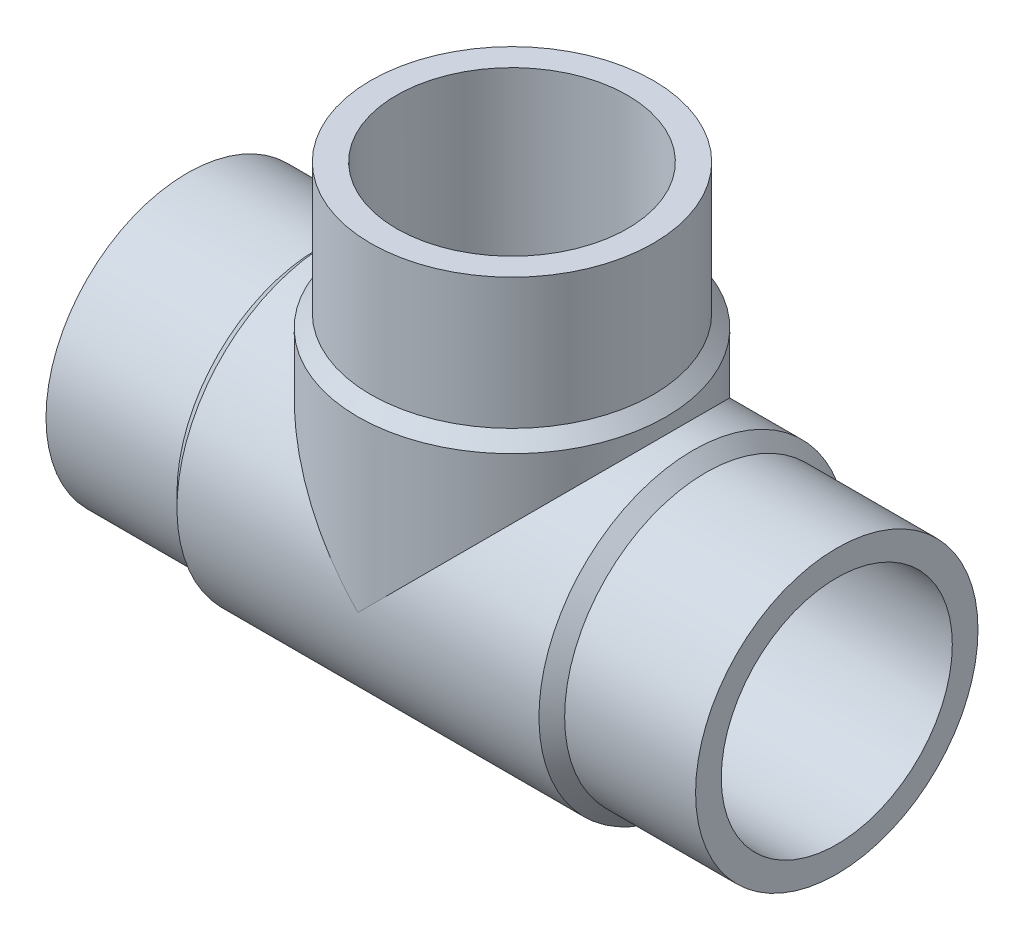
ISO-10303-21;
HEADER;
FILE_DESCRIPTION(('STEP AP214'),'2;1');
FILE_NAME('part.step','',(''),(''),'','','');
FILE_SCHEMA(('AUTOMOTIVE_DESIGN { 1 0 10303 214 1 1 1 1 }'));
ENDSEC;
DATA;
#1=APPLICATION_CONTEXT('core data for automotive mechanical design processes');
#2=APPLICATION_PROTOCOL_DEFINITION('international standard','automotive_design',2000,#1);
#3=PRODUCT_CONTEXT('',#1,'mechanical');
#4=PRODUCT('Part','Part','',(#3));
#5=PRODUCT_RELATED_PRODUCT_CATEGORY('part','',(#4));
#6=PRODUCT_DEFINITION_FORMATION('','',#4);
#7=PRODUCT_DEFINITION_CONTEXT('part definition',#1,'design');
#8=PRODUCT_DEFINITION('design','',#6,#7);
#9=PRODUCT_DEFINITION_SHAPE('','',#8);
#10=(LENGTH_UNIT() NAMED_UNIT(*) SI_UNIT(.MILLI.,.METRE.));
#11=(NAMED_UNIT(*) PLANE_ANGLE_UNIT() SI_UNIT($,.RADIAN.));
#12=(NAMED_UNIT(*) SI_UNIT($,.STERADIAN.) SOLID_ANGLE_UNIT());
#13=UNCERTAINTY_MEASURE_WITH_UNIT(LENGTH_MEASURE(1.E-05),#10,'distance_accuracy_value','');
#14=(GEOMETRIC_REPRESENTATION_CONTEXT(3) GLOBAL_UNCERTAINTY_ASSIGNED_CONTEXT((#13)) GLOBAL_UNIT_ASSIGNED_CONTEXT((#10,
#11,#12)) REPRESENTATION_CONTEXT('',''));
#15=CARTESIAN_POINT('',(0.,0.,0.));
#16=DIRECTION('',(0.,0.,1.));
#17=DIRECTION('',(1.,0.,0.));
#18=AXIS2_PLACEMENT_3D('',#15,#16,#17);
#19=CARTESIAN_POINT('',(-126.5,122.,0.));
#20=DIRECTION('',(0.,1.,0.));
#21=DIRECTION('',(0.,0.,1.));
#22=AXIS2_PLACEMENT_3D('',#19,#20,#21);
#23=CYLINDRICAL_SURFACE('',#22,55.);
#24=CARTESIAN_POINT('',(-126.5,122.,0.));
#25=DIRECTION('',(0.,1.,0.));
#26=DIRECTION('',(0.,0.,1.));
#27=AXIS2_PLACEMENT_3D('',#24,#25,#26);
#28=CIRCLE('',#27,55.);
#29=CARTESIAN_POINT('',(-126.5,122.,55.));
#30=VERTEX_POINT('',#29);
#31=EDGE_CURVE('E18',#30,#30,#28,.T.);
#32=ORIENTED_EDGE('',*,*,#31,.F.);
#33=EDGE_LOOP('',(#32));
#34=FACE_BOUND('',#33,.T.);
#35=CARTESIAN_POINT('',(-126.5,71.,0.));
#36=DIRECTION('',(0.,1.,0.));
#37=DIRECTION('',(1.,0.,0.));
#38=AXIS2_PLACEMENT_3D('',#35,#36,#37);
#39=CIRCLE('',#38,55.);
#40=CARTESIAN_POINT('',(-71.5,71.,0.));
#41=VERTEX_POINT('',#40);
#42=EDGE_CURVE('E71',#41,#41,#39,.F.);
#43=ORIENTED_EDGE('',*,*,#42,.F.);
#44=EDGE_LOOP('',(#43));
#45=FACE_BOUND('',#44,.T.);
#46=ADVANCED_FACE('F15',(#34,#45),#23,.T.);
#47=CARTESIAN_POINT('',(-126.5,71.,0.));
#48=DIRECTION('',(0.,-1.,0.));
#49=DIRECTION('',(0.,0.,-1.));
#50=AXIS2_PLACEMENT_3D('',#47,#48,#49);
#51=CONICAL_SURFACE('',#50,55.,0.785398163397444);
#52=CARTESIAN_POINT('',(-126.5,66.,0.));
#53=DIRECTION('',(0.,1.,0.));
#54=DIRECTION('',(1.,0.,0.));
#55=AXIS2_PLACEMENT_3D('',#52,#53,#54);
#56=CIRCLE('',#55,60.);
#57=CARTESIAN_POINT('',(-66.5,66.,0.));
#58=VERTEX_POINT('',#57);
#59=EDGE_CURVE('E60',#58,#58,#56,.F.);
#60=ORIENTED_EDGE('',*,*,#59,.F.);
#61=EDGE_LOOP('',(#60));
#62=FACE_BOUND('',#61,.T.);
#63=ORIENTED_EDGE('',*,*,#42,.T.);
#64=EDGE_LOOP('',(#63));
#65=FACE_BOUND('',#64,.T.);
#66=ADVANCED_FACE('F141',(#62,#65),#51,.T.);
#67=CARTESIAN_POINT('',(-51.,0.,0.));
#68=DIRECTION('',(-1.,0.,0.));
#69=DIRECTION('',(0.,0.,1.));
#70=AXIS2_PLACEMENT_3D('',#67,#68,#69);
#71=CYLINDRICAL_SURFACE('',#70,55.);
#72=CARTESIAN_POINT('',(-51.,0.,0.));
#73=DIRECTION('',(1.,0.,0.));
#74=DIRECTION('',(0.,1.,0.));
#75=AXIS2_PLACEMENT_3D('',#72,#73,#74);
#76=CIRCLE('',#75,55.);
#77=CARTESIAN_POINT('',(-51.,55.,0.));
#78=VERTEX_POINT('',#77);
#79=EDGE_CURVE('E64',#78,#78,#76,.F.);
#80=ORIENTED_EDGE('',*,*,#79,.F.);
#81=EDGE_LOOP('',(#80));
#82=FACE_BOUND('',#81,.T.);
#83=CARTESIAN_POINT('',(0.,0.,0.));
#84=DIRECTION('',(-1.,0.,0.));
#85=DIRECTION('',(0.,0.,1.));
#86=AXIS2_PLACEMENT_3D('',#83,#84,#85);
#87=CIRCLE('',#86,55.);
#88=CARTESIAN_POINT('',(0.,0.,55.));
#89=VERTEX_POINT('',#88);
#90=EDGE_CURVE('E58',#89,#89,#87,.F.);
#91=ORIENTED_EDGE('',*,*,#90,.F.);
#92=EDGE_LOOP('',(#91));
#93=FACE_BOUND('',#92,.T.);
#94=ADVANCED_FACE('F136',(#82,#93),#71,.T.);
#95=CARTESIAN_POINT('',(-181.5,122.,55.6600021084419));
#96=DIRECTION('',(0.,1.,0.));
#97=DIRECTION('',(1.,0.,0.));
#98=AXIS2_PLACEMENT_3D('',#95,#96,#97);
#99=PLANE('',#98);
#100=CARTESIAN_POINT('',(-126.5,122.,0.));
#101=DIRECTION('',(0.,1.,0.));
#102=DIRECTION('',(0.,0.,1.));
#103=AXIS2_PLACEMENT_3D('',#100,#101,#102);
#104=CIRCLE('',#103,45.);
#105=CARTESIAN_POINT('',(-126.5,122.,45.));
#106=VERTEX_POINT('',#105);
#107=EDGE_CURVE('E52',#106,#106,#104,.T.);
#108=ORIENTED_EDGE('',*,*,#107,.F.);
#109=EDGE_LOOP('',(#108));
#110=FACE_BOUND('',#109,.T.);
#111=ORIENTED_EDGE('',*,*,#31,.T.);
#112=EDGE_LOOP('',(#111));
#113=FACE_BOUND('',#112,.T.);
#114=ADVANCED_FACE('F130',(#110,#113),#99,.T.);
#115=CARTESIAN_POINT('',(-51.,0.,0.));
#116=DIRECTION('',(-1.,0.,0.));
#117=DIRECTION('',(0.,0.,1.));
#118=AXIS2_PLACEMENT_3D('',#115,#116,#117);
#119=CONICAL_SURFACE('',#118,55.,0.785398163397448);
#120=ORIENTED_EDGE('',*,*,#79,.T.);
#121=EDGE_LOOP('',(#120));
#122=FACE_BOUND('',#121,.T.);
#123=CARTESIAN_POINT('',(-56.,0.,0.));
#124=DIRECTION('',(-1.,0.,0.));
#125=DIRECTION('',(0.,1.,0.));
#126=AXIS2_PLACEMENT_3D('',#123,#124,#125);
#127=CIRCLE('',#126,60.);
#128=CARTESIAN_POINT('',(-56.,60.,0.));
#129=VERTEX_POINT('',#128);
#130=EDGE_CURVE('E49',#129,#129,#127,.T.);
#131=ORIENTED_EDGE('',*,*,#130,.F.);
#132=EDGE_LOOP('',(#131));
#133=FACE_BOUND('',#132,.T.);
#134=ADVANCED_FACE('F95',(#122,#133),#119,.T.);
#135=CARTESIAN_POINT('',(-126.5,66.,0.));
#136=DIRECTION('',(0.,1.,0.));
#137=DIRECTION('',(0.,0.,1.));
#138=AXIS2_PLACEMENT_3D('',#135,#136,#137);
#139=CYLINDRICAL_SURFACE('',#138,60.);
#140=CARTESIAN_POINT('',(-126.5,0.,0.));
#141=DIRECTION('',(0.707106781186547,0.707106781186547,0.));
#142=DIRECTION('',(-0.707106781186547,0.707106781186547,0.));
#143=AXIS2_PLACEMENT_3D('',#140,#141,#142);
#144=ELLIPSE('',#143,84.8528137423857,60.);
#145=CARTESIAN_POINT('',(-126.5,0.,60.));
#146=VERTEX_POINT('',#145);
#147=CARTESIAN_POINT('',(-126.5,0.,-60.));
#148=VERTEX_POINT('',#147);
#149=EDGE_CURVE('E44',#146,#148,#144,.F.);
#150=ORIENTED_EDGE('',*,*,#149,.F.);
#151=CARTESIAN_POINT('',(-126.5,0.,0.));
#152=DIRECTION('',(-0.707106781186547,0.707106781186547,0.));
#153=DIRECTION('',(0.707106781186547,0.707106781186547,0.));
#154=AXIS2_PLACEMENT_3D('',#151,#152,#153);
#155=ELLIPSE('',#154,84.8528137423857,60.);
#156=EDGE_CURVE('E40',#148,#146,#155,.F.);
#157=ORIENTED_EDGE('',*,*,#156,.F.);
#158=EDGE_LOOP('',(#150,#157));
#159=FACE_BOUND('',#158,.T.);
#160=ORIENTED_EDGE('',*,*,#59,.T.);
#161=EDGE_LOOP('',(#160));
#162=FACE_BOUND('',#161,.T.);
#163=ADVANCED_FACE('F47',(#159,#162),#139,.T.);
#164=CARTESIAN_POINT('',(0.,55.,55.6600021081709));
#165=DIRECTION('',(1.,0.,0.));
#166=DIRECTION('',(0.,-1.,0.));
#167=AXIS2_PLACEMENT_3D('',#164,#165,#166);
#168=PLANE('',#167);
#169=CARTESIAN_POINT('',(0.,0.,0.));
#170=DIRECTION('',(-1.,0.,0.));
#171=DIRECTION('',(0.,0.,1.));
#172=AXIS2_PLACEMENT_3D('',#169,#170,#171);
#173=CIRCLE('',#172,45.);
#174=CARTESIAN_POINT('',(0.,0.,45.));
#175=VERTEX_POINT('',#174);
#176=EDGE_CURVE('E45',#175,#175,#173,.F.);
#177=ORIENTED_EDGE('',*,*,#176,.F.);
#178=EDGE_LOOP('',(#177));
#179=FACE_BOUND('',#178,.T.);
#180=ORIENTED_EDGE('',*,*,#90,.T.);
#181=EDGE_LOOP('',(#180));
#182=FACE_BOUND('',#181,.T.);
#183=ADVANCED_FACE('F85',(#179,#182),#168,.T.);
#184=CARTESIAN_POINT('',(-126.5,0.,0.));
#185=DIRECTION('',(0.,1.,0.));
#186=DIRECTION('',(0.,0.,1.));
#187=AXIS2_PLACEMENT_3D('',#184,#185,#186);
#188=CYLINDRICAL_SURFACE('',#187,45.);
#189=CARTESIAN_POINT('',(-126.5,0.,0.));
#190=DIRECTION('',(-0.707106781186547,-0.707106781186547,0.));
#191=DIRECTION('',(-0.707106781186547,0.707106781186547,0.));
#192=AXIS2_PLACEMENT_3D('',#189,#190,#191);
#193=ELLIPSE('',#192,63.6396103067893,45.);
#194=CARTESIAN_POINT('',(-126.5,0.,-45.));
#195=VERTEX_POINT('',#194);
#196=CARTESIAN_POINT('',(-126.5,0.,45.));
#197=VERTEX_POINT('',#196);
#198=EDGE_CURVE('E78',#195,#197,#193,.F.);
#199=ORIENTED_EDGE('',*,*,#198,.F.);
#200=CARTESIAN_POINT('',(-126.5,0.,0.));
#201=DIRECTION('',(-0.707106781186547,0.707106781186547,0.));
#202=DIRECTION('',(0.707106781186547,0.707106781186547,0.));
#203=AXIS2_PLACEMENT_3D('',#200,#201,#202);
#204=ELLIPSE('',#203,63.6396103067893,45.);
#205=EDGE_CURVE('E32',#195,#197,#204,.F.);
#206=ORIENTED_EDGE('',*,*,#205,.T.);
#207=EDGE_LOOP('',(#199,#206));
#208=FACE_BOUND('',#207,.T.);
#209=ORIENTED_EDGE('',*,*,#107,.T.);
#210=EDGE_LOOP('',(#209));
#211=FACE_BOUND('',#210,.T.);
#212=ADVANCED_FACE('F87',(#208,#211),#188,.F.);
#213=CARTESIAN_POINT('',(-197.,0.,0.));
#214=DIRECTION('',(-1.,0.,0.));
#215=DIRECTION('',(0.,0.,1.));
#216=AXIS2_PLACEMENT_3D('',#213,#214,#215);
#217=CYLINDRICAL_SURFACE('',#216,60.);
#218=ORIENTED_EDGE('',*,*,#130,.T.);
#219=EDGE_LOOP('',(#218));
#220=FACE_BOUND('',#219,.T.);
#221=CARTESIAN_POINT('',(-197.,0.,0.));
#222=DIRECTION('',(-1.,0.,0.));
#223=DIRECTION('',(0.,1.,0.));
#224=AXIS2_PLACEMENT_3D('',#221,#222,#223);
#225=CIRCLE('',#224,60.);
#226=CARTESIAN_POINT('',(-197.,60.,0.));
#227=VERTEX_POINT('',#226);
#228=EDGE_CURVE('E77',#227,#227,#225,.T.);
#229=ORIENTED_EDGE('',*,*,#228,.F.);
#230=EDGE_LOOP('',(#229));
#231=FACE_BOUND('',#230,.T.);
#232=ORIENTED_EDGE('',*,*,#149,.T.);
#233=ORIENTED_EDGE('',*,*,#156,.T.);
#234=EDGE_LOOP('',(#232,#233));
#235=FACE_BOUND('',#234,.T.);
#236=ADVANCED_FACE('F43',(#220,#231,#235),#217,.T.);
#237=CARTESIAN_POINT('',(-126.5,0.,0.));
#238=DIRECTION('',(-1.,0.,0.));
#239=DIRECTION('',(0.,0.,1.));
#240=AXIS2_PLACEMENT_3D('',#237,#238,#239);
#241=CYLINDRICAL_SURFACE('',#240,45.);
#242=ORIENTED_EDGE('',*,*,#205,.F.);
#243=ORIENTED_EDGE('',*,*,#198,.T.);
#244=EDGE_LOOP('',(#242,#243));
#245=FACE_BOUND('',#244,.T.);
#246=ORIENTED_EDGE('',*,*,#176,.T.);
#247=EDGE_LOOP('',(#246));
#248=FACE_BOUND('',#247,.T.);
#249=CARTESIAN_POINT('',(-253.,0.,0.));
#250=DIRECTION('',(-1.,0.,0.));
#251=DIRECTION('',(0.,0.,1.));
#252=AXIS2_PLACEMENT_3D('',#249,#250,#251);
#253=CIRCLE('',#252,45.);
#254=CARTESIAN_POINT('',(-253.,0.,45.));
#255=VERTEX_POINT('',#254);
#256=EDGE_CURVE('E74',#255,#255,#253,.F.);
#257=ORIENTED_EDGE('',*,*,#256,.F.);
#258=EDGE_LOOP('',(#257));
#259=FACE_BOUND('',#258,.T.);
#260=ADVANCED_FACE('F82',(#245,#248,#259),#241,.F.);
#261=CARTESIAN_POINT('',(-202.,0.,0.));
#262=DIRECTION('',(1.,0.,0.));
#263=DIRECTION('',(0.,0.,-1.));
#264=AXIS2_PLACEMENT_3D('',#261,#262,#263);
#265=CONICAL_SURFACE('',#264,55.,0.785398163397449);
#266=ORIENTED_EDGE('',*,*,#228,.T.);
#267=EDGE_LOOP('',(#266));
#268=FACE_BOUND('',#267,.T.);
#269=CARTESIAN_POINT('',(-202.,0.,0.));
#270=DIRECTION('',(-1.,0.,0.));
#271=DIRECTION('',(0.,1.,0.));
#272=AXIS2_PLACEMENT_3D('',#269,#270,#271);
#273=CIRCLE('',#272,55.);
#274=CARTESIAN_POINT('',(-202.,55.,0.));
#275=VERTEX_POINT('',#274);
#276=EDGE_CURVE('E24',#275,#275,#273,.T.);
#277=ORIENTED_EDGE('',*,*,#276,.F.);
#278=EDGE_LOOP('',(#277));
#279=FACE_BOUND('',#278,.T.);
#280=ADVANCED_FACE('F105',(#268,#279),#265,.T.);
#281=CARTESIAN_POINT('',(-253.,-55.,55.660002108172));
#282=DIRECTION('',(-1.,0.,0.));
#283=DIRECTION('',(0.,1.,0.));
#284=AXIS2_PLACEMENT_3D('',#281,#282,#283);
#285=PLANE('',#284);
#286=ORIENTED_EDGE('',*,*,#256,.T.);
#287=EDGE_LOOP('',(#286));
#288=FACE_BOUND('',#287,.T.);
#289=CARTESIAN_POINT('',(-253.,0.,0.));
#290=DIRECTION('',(-1.,0.,0.));
#291=DIRECTION('',(0.,0.,1.));
#292=AXIS2_PLACEMENT_3D('',#289,#290,#291);
#293=CIRCLE('',#292,55.);
#294=CARTESIAN_POINT('',(-253.,0.,55.));
#295=VERTEX_POINT('',#294);
#296=EDGE_CURVE('E9',#295,#295,#293,.F.);
#297=ORIENTED_EDGE('',*,*,#296,.F.);
#298=EDGE_LOOP('',(#297));
#299=FACE_BOUND('',#298,.T.);
#300=ADVANCED_FACE('F99',(#288,#299),#285,.T.);
#301=CARTESIAN_POINT('',(-253.,0.,0.));
#302=DIRECTION('',(-1.,0.,0.));
#303=DIRECTION('',(0.,0.,1.));
#304=AXIS2_PLACEMENT_3D('',#301,#302,#303);
#305=CYLINDRICAL_SURFACE('',#304,55.);
#306=ORIENTED_EDGE('',*,*,#276,.T.);
#307=EDGE_LOOP('',(#306));
#308=FACE_BOUND('',#307,.T.);
#309=ORIENTED_EDGE('',*,*,#296,.T.);
#310=EDGE_LOOP('',(#309));
#311=FACE_BOUND('',#310,.T.);
#312=ADVANCED_FACE('F97',(#308,#311),#305,.T.);
#313=CLOSED_SHELL('',(#46,#66,#94,#114,#134,#163,#183,#212,#236,#260,#280,#300,#312));
#314=MANIFOLD_SOLID_BREP('B1',#313);
#315=ADVANCED_BREP_SHAPE_REPRESENTATION('',(#18,#314),#14);
#316=SHAPE_DEFINITION_REPRESENTATION(#9,#315);
ENDSEC;
END-ISO-10303-21;
